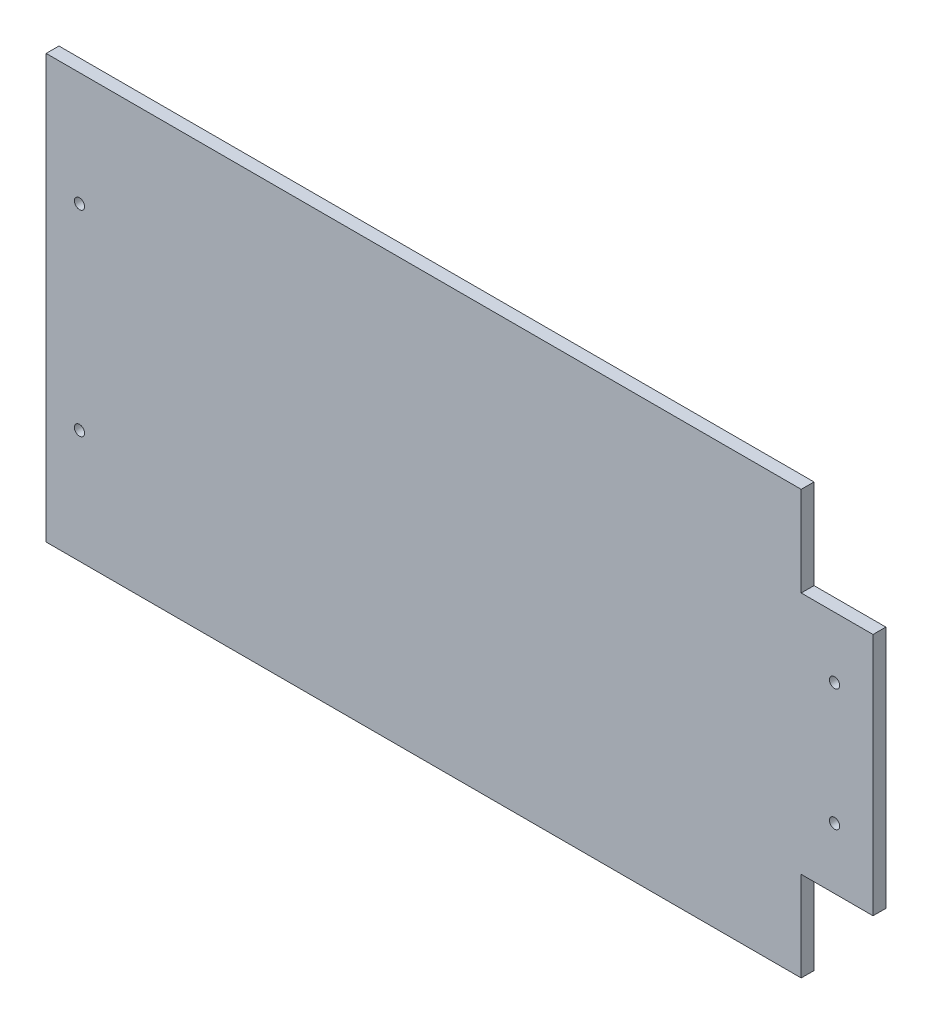
ISO-10303-21;
HEADER;
FILE_DESCRIPTION(('STEP AP214'),'2;1');
FILE_NAME('part.step','',(''),(''),'','','');
FILE_SCHEMA(('AUTOMOTIVE_DESIGN { 1 0 10303 214 1 1 1 1 }'));
ENDSEC;
DATA;
#1=APPLICATION_CONTEXT('core data for automotive mechanical design processes');
#2=APPLICATION_PROTOCOL_DEFINITION('international standard','automotive_design',2000,#1);
#3=PRODUCT_CONTEXT('',#1,'mechanical');
#4=PRODUCT('Part','Part','',(#3));
#5=PRODUCT_RELATED_PRODUCT_CATEGORY('part','',(#4));
#6=PRODUCT_DEFINITION_FORMATION('','',#4);
#7=PRODUCT_DEFINITION_CONTEXT('part definition',#1,'design');
#8=PRODUCT_DEFINITION('design','',#6,#7);
#9=PRODUCT_DEFINITION_SHAPE('','',#8);
#10=(LENGTH_UNIT() NAMED_UNIT(*) SI_UNIT(.MILLI.,.METRE.));
#11=(NAMED_UNIT(*) PLANE_ANGLE_UNIT() SI_UNIT($,.RADIAN.));
#12=(NAMED_UNIT(*) SI_UNIT($,.STERADIAN.) SOLID_ANGLE_UNIT());
#13=UNCERTAINTY_MEASURE_WITH_UNIT(LENGTH_MEASURE(1.E-05),#10,'distance_accuracy_value','');
#14=(GEOMETRIC_REPRESENTATION_CONTEXT(3) GLOBAL_UNCERTAINTY_ASSIGNED_CONTEXT((#13)) GLOBAL_UNIT_ASSIGNED_CONTEXT((#10,
#11,#12)) REPRESENTATION_CONTEXT('',''));
#15=CARTESIAN_POINT('',(0.,0.,0.));
#16=DIRECTION('',(0.,0.,1.));
#17=DIRECTION('',(1.,0.,0.));
#18=AXIS2_PLACEMENT_3D('',#15,#16,#17);
#19=CARTESIAN_POINT('',(-164.220930232558,82.5,5.));
#20=DIRECTION('',(0.,-1.,0.));
#21=DIRECTION('',(0.,0.,-1.));
#22=AXIS2_PLACEMENT_3D('',#19,#20,#21);
#23=PLANE('',#22);
#24=DIRECTION('',(-1.,0.,0.));
#25=VECTOR('',#24,1.);
#26=CARTESIAN_POINT('',(-164.220930232558,82.5,0.));
#27=LINE('',#26,#25);
#28=CARTESIAN_POINT('',(130.179069767442,82.5,0.));
#29=VERTEX_POINT('',#28);
#30=CARTESIAN_POINT('',(-164.220930232558,82.5,0.));
#31=VERTEX_POINT('',#30);
#32=EDGE_CURVE('E148',#29,#31,#27,.T.);
#33=ORIENTED_EDGE('',*,*,#32,.T.);
#34=DIRECTION('',(0.,0.,-1.));
#35=VECTOR('',#34,1.);
#36=CARTESIAN_POINT('',(-164.220930232558,82.5,5.));
#37=LINE('',#36,#35);
#38=CARTESIAN_POINT('',(-164.220930232558,82.5,5.));
#39=VERTEX_POINT('',#38);
#40=EDGE_CURVE('E11',#39,#31,#37,.T.);
#41=ORIENTED_EDGE('',*,*,#40,.F.);
#42=DIRECTION('',(-1.,0.,0.));
#43=VECTOR('',#42,1.);
#44=CARTESIAN_POINT('',(-164.220930232558,82.5,5.));
#45=LINE('',#44,#43);
#46=CARTESIAN_POINT('',(130.179069767442,82.5,5.));
#47=VERTEX_POINT('',#46);
#48=EDGE_CURVE('E170',#47,#39,#45,.T.);
#49=ORIENTED_EDGE('',*,*,#48,.F.);
#50=DIRECTION('',(0.,0.,-1.));
#51=VECTOR('',#50,1.);
#52=CARTESIAN_POINT('',(130.179069767442,82.5,5.));
#53=LINE('',#52,#51);
#54=EDGE_CURVE('E144',#47,#29,#53,.T.);
#55=ORIENTED_EDGE('',*,*,#54,.T.);
#56=EDGE_LOOP('',(#33,#41,#49,#55));
#57=FACE_BOUND('',#56,.T.);
#58=ADVANCED_FACE('F45',(#57),#23,.F.);
#59=CARTESIAN_POINT('',(-164.220930232558,-82.5,5.));
#60=DIRECTION('',(1.,0.,0.));
#61=DIRECTION('',(0.,0.,-1.));
#62=AXIS2_PLACEMENT_3D('',#59,#60,#61);
#63=PLANE('',#62);
#64=DIRECTION('',(0.,-1.,0.));
#65=VECTOR('',#64,1.);
#66=CARTESIAN_POINT('',(-164.220930232558,-82.5,0.));
#67=LINE('',#66,#65);
#68=CARTESIAN_POINT('',(-164.220930232558,-82.5,0.));
#69=VERTEX_POINT('',#68);
#70=EDGE_CURVE('E152',#31,#69,#67,.T.);
#71=ORIENTED_EDGE('',*,*,#70,.T.);
#72=DIRECTION('',(0.,0.,-1.));
#73=VECTOR('',#72,1.);
#74=CARTESIAN_POINT('',(-164.220930232558,-82.5,5.));
#75=LINE('',#74,#73);
#76=CARTESIAN_POINT('',(-164.220930232558,-82.5,5.));
#77=VERTEX_POINT('',#76);
#78=EDGE_CURVE('E55',#77,#69,#75,.T.);
#79=ORIENTED_EDGE('',*,*,#78,.F.);
#80=DIRECTION('',(0.,-1.,0.));
#81=VECTOR('',#80,1.);
#82=CARTESIAN_POINT('',(-164.220930232558,-82.5,5.));
#83=LINE('',#82,#81);
#84=EDGE_CURVE('E107',#39,#77,#83,.T.);
#85=ORIENTED_EDGE('',*,*,#84,.F.);
#86=ORIENTED_EDGE('',*,*,#40,.T.);
#87=EDGE_LOOP('',(#71,#79,#85,#86));
#88=FACE_BOUND('',#87,.T.);
#89=ADVANCED_FACE('F234',(#88),#63,.F.);
#90=CARTESIAN_POINT('',(-164.220930232558,-82.5,5.));
#91=DIRECTION('',(0.,1.,0.));
#92=DIRECTION('',(0.,0.,1.));
#93=AXIS2_PLACEMENT_3D('',#90,#91,#92);
#94=PLANE('',#93);
#95=DIRECTION('',(1.,0.,0.));
#96=VECTOR('',#95,1.);
#97=CARTESIAN_POINT('',(-164.220930232558,-82.5,0.));
#98=LINE('',#97,#96);
#99=CARTESIAN_POINT('',(130.179069767442,-82.5,0.));
#100=VERTEX_POINT('',#99);
#101=EDGE_CURVE('E155',#69,#100,#98,.T.);
#102=ORIENTED_EDGE('',*,*,#101,.T.);
#103=DIRECTION('',(0.,0.,-1.));
#104=VECTOR('',#103,1.);
#105=CARTESIAN_POINT('',(130.179069767442,-82.5,5.));
#106=LINE('',#105,#104);
#107=CARTESIAN_POINT('',(130.179069767442,-82.5,5.));
#108=VERTEX_POINT('',#107);
#109=EDGE_CURVE('E181',#108,#100,#106,.T.);
#110=ORIENTED_EDGE('',*,*,#109,.F.);
#111=DIRECTION('',(1.,0.,0.));
#112=VECTOR('',#111,1.);
#113=CARTESIAN_POINT('',(-164.220930232558,-82.5,5.));
#114=LINE('',#113,#112);
#115=EDGE_CURVE('E340',#77,#108,#114,.T.);
#116=ORIENTED_EDGE('',*,*,#115,.F.);
#117=ORIENTED_EDGE('',*,*,#78,.T.);
#118=EDGE_LOOP('',(#102,#110,#116,#117));
#119=FACE_BOUND('',#118,.T.);
#120=ADVANCED_FACE('F238',(#119),#94,.F.);
#121=CARTESIAN_POINT('',(130.179069767442,-82.5,5.));
#122=DIRECTION('',(-1.,0.,0.));
#123=DIRECTION('',(0.,0.,1.));
#124=AXIS2_PLACEMENT_3D('',#121,#122,#123);
#125=PLANE('',#124);
#126=DIRECTION('',(0.,1.,0.));
#127=VECTOR('',#126,1.);
#128=CARTESIAN_POINT('',(130.179069767442,-82.5,0.));
#129=LINE('',#128,#127);
#130=CARTESIAN_POINT('',(130.179069767442,-47.5,0.));
#131=VERTEX_POINT('',#130);
#132=EDGE_CURVE('E158',#100,#131,#129,.T.);
#133=ORIENTED_EDGE('',*,*,#132,.T.);
#134=DIRECTION('',(0.,0.,-1.));
#135=VECTOR('',#134,1.);
#136=CARTESIAN_POINT('',(130.179069767442,-47.5,5.));
#137=LINE('',#136,#135);
#138=CARTESIAN_POINT('',(130.179069767442,-47.5,5.));
#139=VERTEX_POINT('',#138);
#140=EDGE_CURVE('E177',#139,#131,#137,.T.);
#141=ORIENTED_EDGE('',*,*,#140,.F.);
#142=DIRECTION('',(0.,1.,0.));
#143=VECTOR('',#142,1.);
#144=CARTESIAN_POINT('',(130.179069767442,-82.5,5.));
#145=LINE('',#144,#143);
#146=EDGE_CURVE('E343',#108,#139,#145,.T.);
#147=ORIENTED_EDGE('',*,*,#146,.F.);
#148=ORIENTED_EDGE('',*,*,#109,.T.);
#149=EDGE_LOOP('',(#133,#141,#147,#148));
#150=FACE_BOUND('',#149,.T.);
#151=ADVANCED_FACE('F242',(#150),#125,.F.);
#152=CARTESIAN_POINT('',(130.179069767442,-47.5,5.));
#153=DIRECTION('',(0.,1.,0.));
#154=DIRECTION('',(0.,0.,1.));
#155=AXIS2_PLACEMENT_3D('',#152,#153,#154);
#156=PLANE('',#155);
#157=DIRECTION('',(1.,0.,0.));
#158=VECTOR('',#157,1.);
#159=CARTESIAN_POINT('',(130.179069767442,-47.5,0.));
#160=LINE('',#159,#158);
#161=CARTESIAN_POINT('',(158.179069767442,-47.5,0.));
#162=VERTEX_POINT('',#161);
#163=EDGE_CURVE('E161',#131,#162,#160,.T.);
#164=ORIENTED_EDGE('',*,*,#163,.T.);
#165=DIRECTION('',(0.,0.,-1.));
#166=VECTOR('',#165,1.);
#167=CARTESIAN_POINT('',(158.179069767442,-47.5,5.));
#168=LINE('',#167,#166);
#169=CARTESIAN_POINT('',(158.179069767442,-47.5,5.));
#170=VERTEX_POINT('',#169);
#171=EDGE_CURVE('E137',#170,#162,#168,.T.);
#172=ORIENTED_EDGE('',*,*,#171,.F.);
#173=DIRECTION('',(1.,0.,0.));
#174=VECTOR('',#173,1.);
#175=CARTESIAN_POINT('',(130.179069767442,-47.5,5.));
#176=LINE('',#175,#174);
#177=EDGE_CURVE('E126',#139,#170,#176,.T.);
#178=ORIENTED_EDGE('',*,*,#177,.F.);
#179=ORIENTED_EDGE('',*,*,#140,.T.);
#180=EDGE_LOOP('',(#164,#172,#178,#179));
#181=FACE_BOUND('',#180,.T.);
#182=ADVANCED_FACE('F248',(#181),#156,.F.);
#183=CARTESIAN_POINT('',(158.179069767442,47.5,5.));
#184=DIRECTION('',(-1.,0.,0.));
#185=DIRECTION('',(0.,0.,1.));
#186=AXIS2_PLACEMENT_3D('',#183,#184,#185);
#187=PLANE('',#186);
#188=DIRECTION('',(0.,1.,0.));
#189=VECTOR('',#188,1.);
#190=CARTESIAN_POINT('',(158.179069767442,47.5,0.));
#191=LINE('',#190,#189);
#192=CARTESIAN_POINT('',(158.179069767442,47.5,0.));
#193=VERTEX_POINT('',#192);
#194=EDGE_CURVE('E135',#162,#193,#191,.T.);
#195=ORIENTED_EDGE('',*,*,#194,.T.);
#196=DIRECTION('',(0.,0.,-1.));
#197=VECTOR('',#196,1.);
#198=CARTESIAN_POINT('',(158.179069767442,47.5,5.));
#199=LINE('',#198,#197);
#200=CARTESIAN_POINT('',(158.179069767442,47.5,5.));
#201=VERTEX_POINT('',#200);
#202=EDGE_CURVE('E132',#201,#193,#199,.T.);
#203=ORIENTED_EDGE('',*,*,#202,.F.);
#204=DIRECTION('',(0.,1.,0.));
#205=VECTOR('',#204,1.);
#206=CARTESIAN_POINT('',(158.179069767442,47.5,5.));
#207=LINE('',#206,#205);
#208=EDGE_CURVE('E120',#170,#201,#207,.T.);
#209=ORIENTED_EDGE('',*,*,#208,.F.);
#210=ORIENTED_EDGE('',*,*,#171,.T.);
#211=EDGE_LOOP('',(#195,#203,#209,#210));
#212=FACE_BOUND('',#211,.T.);
#213=ADVANCED_FACE('F133',(#212),#187,.F.);
#214=CARTESIAN_POINT('',(130.179069767442,47.5,5.));
#215=DIRECTION('',(0.,-1.,0.));
#216=DIRECTION('',(0.,0.,-1.));
#217=AXIS2_PLACEMENT_3D('',#214,#215,#216);
#218=PLANE('',#217);
#219=DIRECTION('',(-1.,0.,0.));
#220=VECTOR('',#219,1.);
#221=CARTESIAN_POINT('',(130.179069767442,47.5,0.));
#222=LINE('',#221,#220);
#223=CARTESIAN_POINT('',(130.179069767442,47.5,0.));
#224=VERTEX_POINT('',#223);
#225=EDGE_CURVE('E93',#193,#224,#222,.T.);
#226=ORIENTED_EDGE('',*,*,#225,.T.);
#227=DIRECTION('',(0.,0.,-1.));
#228=VECTOR('',#227,1.);
#229=CARTESIAN_POINT('',(130.179069767442,47.5,5.));
#230=LINE('',#229,#228);
#231=CARTESIAN_POINT('',(130.179069767442,47.5,5.));
#232=VERTEX_POINT('',#231);
#233=EDGE_CURVE('E138',#232,#224,#230,.T.);
#234=ORIENTED_EDGE('',*,*,#233,.F.);
#235=DIRECTION('',(-1.,0.,0.));
#236=VECTOR('',#235,1.);
#237=CARTESIAN_POINT('',(130.179069767442,47.5,5.));
#238=LINE('',#237,#236);
#239=EDGE_CURVE('E124',#201,#232,#238,.T.);
#240=ORIENTED_EDGE('',*,*,#239,.F.);
#241=ORIENTED_EDGE('',*,*,#202,.T.);
#242=EDGE_LOOP('',(#226,#234,#240,#241));
#243=FACE_BOUND('',#242,.T.);
#244=ADVANCED_FACE('F140',(#243),#218,.F.);
#245=CARTESIAN_POINT('',(130.179069767442,82.5,5.));
#246=DIRECTION('',(-1.,0.,0.));
#247=DIRECTION('',(0.,0.,1.));
#248=AXIS2_PLACEMENT_3D('',#245,#246,#247);
#249=PLANE('',#248);
#250=DIRECTION('',(0.,1.,0.));
#251=VECTOR('',#250,1.);
#252=CARTESIAN_POINT('',(130.179069767442,82.5,0.));
#253=LINE('',#252,#251);
#254=EDGE_CURVE('E99',#224,#29,#253,.T.);
#255=ORIENTED_EDGE('',*,*,#254,.T.);
#256=ORIENTED_EDGE('',*,*,#54,.F.);
#257=DIRECTION('',(0.,1.,0.));
#258=VECTOR('',#257,1.);
#259=CARTESIAN_POINT('',(130.179069767442,82.5,5.));
#260=LINE('',#259,#258);
#261=EDGE_CURVE('E64',#232,#47,#260,.T.);
#262=ORIENTED_EDGE('',*,*,#261,.F.);
#263=ORIENTED_EDGE('',*,*,#233,.T.);
#264=EDGE_LOOP('',(#255,#256,#262,#263));
#265=FACE_BOUND('',#264,.T.);
#266=ADVANCED_FACE('F223',(#265),#249,.F.);
#267=CARTESIAN_POINT('',(0.,0.,5.));
#268=DIRECTION('',(0.,0.,-1.));
#269=DIRECTION('',(-1.,0.,0.));
#270=AXIS2_PLACEMENT_3D('',#267,#268,#269);
#271=PLANE('',#270);
#272=CARTESIAN_POINT('',(-151.220930232558,38.25,5.));
#273=DIRECTION('',(0.,0.,1.));
#274=DIRECTION('',(1.,0.,0.));
#275=AXIS2_PLACEMENT_3D('',#272,#273,#274);
#276=CIRCLE('',#275,2.);
#277=CARTESIAN_POINT('',(-149.220930232558,38.25,5.));
#278=VERTEX_POINT('',#277);
#279=EDGE_CURVE('E193',#278,#278,#276,.T.);
#280=ORIENTED_EDGE('',*,*,#279,.F.);
#281=EDGE_LOOP('',(#280));
#282=FACE_BOUND('',#281,.T.);
#283=CARTESIAN_POINT('',(143.179069767442,-23.75,5.));
#284=DIRECTION('',(0.,0.,1.));
#285=DIRECTION('',(1.,0.,0.));
#286=AXIS2_PLACEMENT_3D('',#283,#284,#285);
#287=CIRCLE('',#286,2.);
#288=CARTESIAN_POINT('',(145.179069767442,-23.75,5.));
#289=VERTEX_POINT('',#288);
#290=EDGE_CURVE('E322',#289,#289,#287,.T.);
#291=ORIENTED_EDGE('',*,*,#290,.F.);
#292=EDGE_LOOP('',(#291));
#293=FACE_BOUND('',#292,.T.);
#294=CARTESIAN_POINT('',(143.179069767442,23.75,5.));
#295=DIRECTION('',(0.,0.,1.));
#296=DIRECTION('',(1.,0.,0.));
#297=AXIS2_PLACEMENT_3D('',#294,#295,#296);
#298=CIRCLE('',#297,2.);
#299=CARTESIAN_POINT('',(145.179069767442,23.75,5.));
#300=VERTEX_POINT('',#299);
#301=EDGE_CURVE('E325',#300,#300,#298,.T.);
#302=ORIENTED_EDGE('',*,*,#301,.F.);
#303=EDGE_LOOP('',(#302));
#304=FACE_BOUND('',#303,.T.);
#305=CARTESIAN_POINT('',(-151.220930232558,-38.25,5.));
#306=DIRECTION('',(0.,0.,1.));
#307=DIRECTION('',(1.,0.,0.));
#308=AXIS2_PLACEMENT_3D('',#305,#306,#307);
#309=CIRCLE('',#308,2.);
#310=CARTESIAN_POINT('',(-149.220930232558,-38.25,5.));
#311=VERTEX_POINT('',#310);
#312=EDGE_CURVE('E329',#311,#311,#309,.T.);
#313=ORIENTED_EDGE('',*,*,#312,.F.);
#314=EDGE_LOOP('',(#313));
#315=FACE_BOUND('',#314,.T.);
#316=ORIENTED_EDGE('',*,*,#48,.T.);
#317=ORIENTED_EDGE('',*,*,#84,.T.);
#318=ORIENTED_EDGE('',*,*,#115,.T.);
#319=ORIENTED_EDGE('',*,*,#146,.T.);
#320=ORIENTED_EDGE('',*,*,#177,.T.);
#321=ORIENTED_EDGE('',*,*,#208,.T.);
#322=ORIENTED_EDGE('',*,*,#239,.T.);
#323=ORIENTED_EDGE('',*,*,#261,.T.);
#324=EDGE_LOOP('',(#316,#317,#318,#319,#320,#321,#322,#323));
#325=FACE_BOUND('',#324,.T.);
#326=ADVANCED_FACE('F122',(#282,#293,#304,#315,#325),#271,.F.);
#327=CARTESIAN_POINT('',(0.,0.,0.));
#328=DIRECTION('',(0.,0.,-1.));
#329=DIRECTION('',(-1.,0.,0.));
#330=AXIS2_PLACEMENT_3D('',#327,#328,#329);
#331=PLANE('',#330);
#332=CARTESIAN_POINT('',(-151.220930232558,38.25,0.));
#333=DIRECTION('',(0.,0.,-1.));
#334=DIRECTION('',(-1.,0.,0.));
#335=AXIS2_PLACEMENT_3D('',#332,#333,#334);
#336=CIRCLE('',#335,2.);
#337=CARTESIAN_POINT('',(-153.220930232558,38.25,0.));
#338=VERTEX_POINT('',#337);
#339=EDGE_CURVE('E48',#338,#338,#336,.T.);
#340=ORIENTED_EDGE('',*,*,#339,.F.);
#341=EDGE_LOOP('',(#340));
#342=FACE_BOUND('',#341,.T.);
#343=CARTESIAN_POINT('',(143.179069767442,-23.75,0.));
#344=DIRECTION('',(0.,0.,-1.));
#345=DIRECTION('',(-1.,0.,0.));
#346=AXIS2_PLACEMENT_3D('',#343,#344,#345);
#347=CIRCLE('',#346,2.);
#348=CARTESIAN_POINT('',(141.179069767442,-23.75,0.));
#349=VERTEX_POINT('',#348);
#350=EDGE_CURVE('E196',#349,#349,#347,.T.);
#351=ORIENTED_EDGE('',*,*,#350,.F.);
#352=EDGE_LOOP('',(#351));
#353=FACE_BOUND('',#352,.T.);
#354=CARTESIAN_POINT('',(143.179069767442,23.75,0.));
#355=DIRECTION('',(0.,0.,-1.));
#356=DIRECTION('',(-1.,0.,0.));
#357=AXIS2_PLACEMENT_3D('',#354,#355,#356);
#358=CIRCLE('',#357,2.);
#359=CARTESIAN_POINT('',(141.179069767442,23.75,0.));
#360=VERTEX_POINT('',#359);
#361=EDGE_CURVE('E192',#360,#360,#358,.T.);
#362=ORIENTED_EDGE('',*,*,#361,.F.);
#363=EDGE_LOOP('',(#362));
#364=FACE_BOUND('',#363,.T.);
#365=CARTESIAN_POINT('',(-151.220930232558,-38.25,0.));
#366=DIRECTION('',(0.,0.,-1.));
#367=DIRECTION('',(-1.,0.,0.));
#368=AXIS2_PLACEMENT_3D('',#365,#366,#367);
#369=CIRCLE('',#368,2.);
#370=CARTESIAN_POINT('',(-153.220930232558,-38.25,0.));
#371=VERTEX_POINT('',#370);
#372=EDGE_CURVE('E188',#371,#371,#369,.T.);
#373=ORIENTED_EDGE('',*,*,#372,.F.);
#374=EDGE_LOOP('',(#373));
#375=FACE_BOUND('',#374,.T.);
#376=ORIENTED_EDGE('',*,*,#32,.F.);
#377=ORIENTED_EDGE('',*,*,#254,.F.);
#378=ORIENTED_EDGE('',*,*,#225,.F.);
#379=ORIENTED_EDGE('',*,*,#194,.F.);
#380=ORIENTED_EDGE('',*,*,#163,.F.);
#381=ORIENTED_EDGE('',*,*,#132,.F.);
#382=ORIENTED_EDGE('',*,*,#101,.F.);
#383=ORIENTED_EDGE('',*,*,#70,.F.);
#384=EDGE_LOOP('',(#376,#377,#378,#379,#380,#381,#382,#383));
#385=FACE_BOUND('',#384,.T.);
#386=ADVANCED_FACE('F208',(#342,#353,#364,#375,#385),#331,.T.);
#387=CARTESIAN_POINT('',(-151.220930232558,-38.25,-5.));
#388=DIRECTION('',(0.,0.,1.));
#389=DIRECTION('',(1.,0.,0.));
#390=AXIS2_PLACEMENT_3D('',#387,#388,#389);
#391=CYLINDRICAL_SURFACE('',#390,2.);
#392=ORIENTED_EDGE('',*,*,#372,.T.);
#393=EDGE_LOOP('',(#392));
#394=FACE_BOUND('',#393,.T.);
#395=ORIENTED_EDGE('',*,*,#312,.T.);
#396=EDGE_LOOP('',(#395));
#397=FACE_BOUND('',#396,.T.);
#398=ADVANCED_FACE('F211',(#394,#397),#391,.F.);
#399=CARTESIAN_POINT('',(143.179069767442,23.75,-5.));
#400=DIRECTION('',(0.,0.,1.));
#401=DIRECTION('',(1.,0.,0.));
#402=AXIS2_PLACEMENT_3D('',#399,#400,#401);
#403=CYLINDRICAL_SURFACE('',#402,2.);
#404=ORIENTED_EDGE('',*,*,#361,.T.);
#405=EDGE_LOOP('',(#404));
#406=FACE_BOUND('',#405,.T.);
#407=ORIENTED_EDGE('',*,*,#301,.T.);
#408=EDGE_LOOP('',(#407));
#409=FACE_BOUND('',#408,.T.);
#410=ADVANCED_FACE('F289',(#406,#409),#403,.F.);
#411=CARTESIAN_POINT('',(143.179069767442,-23.75,-5.));
#412=DIRECTION('',(0.,0.,1.));
#413=DIRECTION('',(1.,0.,0.));
#414=AXIS2_PLACEMENT_3D('',#411,#412,#413);
#415=CYLINDRICAL_SURFACE('',#414,2.);
#416=ORIENTED_EDGE('',*,*,#350,.T.);
#417=EDGE_LOOP('',(#416));
#418=FACE_BOUND('',#417,.T.);
#419=ORIENTED_EDGE('',*,*,#290,.T.);
#420=EDGE_LOOP('',(#419));
#421=FACE_BOUND('',#420,.T.);
#422=ADVANCED_FACE('F299',(#418,#421),#415,.F.);
#423=CARTESIAN_POINT('',(-151.220930232558,38.25,-5.));
#424=DIRECTION('',(0.,0.,1.));
#425=DIRECTION('',(1.,0.,0.));
#426=AXIS2_PLACEMENT_3D('',#423,#424,#425);
#427=CYLINDRICAL_SURFACE('',#426,2.);
#428=ORIENTED_EDGE('',*,*,#339,.T.);
#429=EDGE_LOOP('',(#428));
#430=FACE_BOUND('',#429,.T.);
#431=ORIENTED_EDGE('',*,*,#279,.T.);
#432=EDGE_LOOP('',(#431));
#433=FACE_BOUND('',#432,.T.);
#434=ADVANCED_FACE('F205',(#430,#433),#427,.F.);
#435=CLOSED_SHELL('',(#58,#89,#120,#151,#182,#213,#244,#266,#326,#386,#398,#410,#422,#434));
#436=MANIFOLD_SOLID_BREP('B2',#435);
#437=ADVANCED_BREP_SHAPE_REPRESENTATION('',(#18,#436),#14);
#438=SHAPE_DEFINITION_REPRESENTATION(#9,#437);
ENDSEC;
END-ISO-10303-21;
